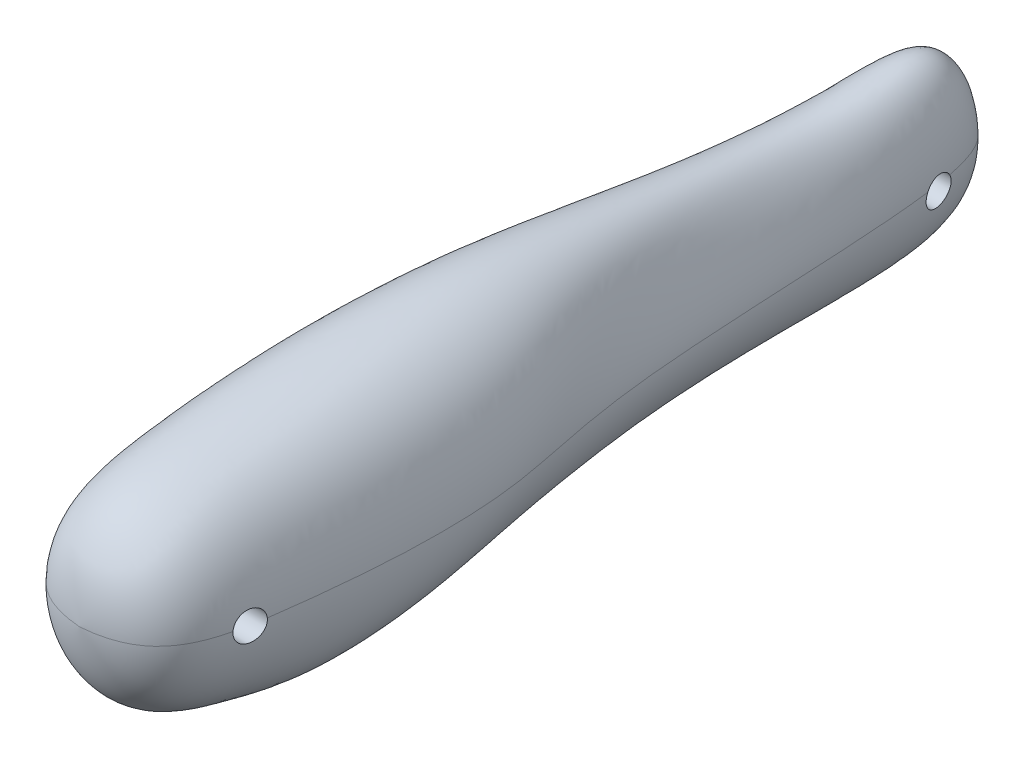
ISO-10303-21;
HEADER;
FILE_DESCRIPTION(('STEP AP214'),'2;1');
FILE_NAME('part.step','',(''),(''),'','','');
FILE_SCHEMA(('AUTOMOTIVE_DESIGN { 1 0 10303 214 1 1 1 1 }'));
ENDSEC;
DATA;
#1=APPLICATION_CONTEXT('core data for automotive mechanical design processes');
#2=APPLICATION_PROTOCOL_DEFINITION('international standard','automotive_design',2000,#1);
#3=PRODUCT_CONTEXT('',#1,'mechanical');
#4=PRODUCT('Part','Part','',(#3));
#5=PRODUCT_RELATED_PRODUCT_CATEGORY('part','',(#4));
#6=PRODUCT_DEFINITION_FORMATION('','',#4);
#7=PRODUCT_DEFINITION_CONTEXT('part definition',#1,'design');
#8=PRODUCT_DEFINITION('design','',#6,#7);
#9=PRODUCT_DEFINITION_SHAPE('','',#8);
#10=(LENGTH_UNIT() NAMED_UNIT(*) SI_UNIT(.MILLI.,.METRE.));
#11=(NAMED_UNIT(*) PLANE_ANGLE_UNIT() SI_UNIT($,.RADIAN.));
#12=(NAMED_UNIT(*) SI_UNIT($,.STERADIAN.) SOLID_ANGLE_UNIT());
#13=UNCERTAINTY_MEASURE_WITH_UNIT(LENGTH_MEASURE(1.E-05),#10,'distance_accuracy_value','');
#14=(GEOMETRIC_REPRESENTATION_CONTEXT(3) GLOBAL_UNCERTAINTY_ASSIGNED_CONTEXT((#13)) GLOBAL_UNIT_ASSIGNED_CONTEXT((#10,
#11,#12)) REPRESENTATION_CONTEXT('',''));
#15=CARTESIAN_POINT('',(0.,0.,0.));
#16=DIRECTION('',(0.,0.,1.));
#17=DIRECTION('',(1.,0.,0.));
#18=AXIS2_PLACEMENT_3D('',#15,#16,#17);
#19=CARTESIAN_POINT('',(-204.079130800979,23.1728124666681,203.553662865172));
#20=CARTESIAN_POINT('',(-204.079130800979,23.1728124666681,203.553662865172));
#21=CARTESIAN_POINT('',(-204.079130800979,23.1728124666681,203.553662865172));
#22=CARTESIAN_POINT('',(-204.079130800979,23.1728124666681,203.553662865172));
#23=CARTESIAN_POINT('',(-204.079130800979,23.1728124666681,203.553662865172));
#24=CARTESIAN_POINT('',(-204.079130800979,23.1728124666681,203.553662865172));
#25=CARTESIAN_POINT('',(-204.079130800979,23.1728124666681,203.553662865172));
#26=CARTESIAN_POINT('',(-228.446348021601,23.1728123364138,201.663956001122));
#27=CARTESIAN_POINT('',(-228.446347912665,30.7846047284628,201.663956001113));
#28=CARTESIAN_POINT('',(-223.17356515452,46.0081892520593,201.663956001114));
#29=CARTESIAN_POINT('',(-204.079130800974,55.4669114657724,201.663956001119));
#30=CARTESIAN_POINT('',(-184.984697101001,46.0081884704255,201.663956001113));
#31=CARTESIAN_POINT('',(-179.711915139516,30.7846044679303,201.663956001122));
#32=CARTESIAN_POINT('',(-179.711915248457,23.1728125969523,201.663956001127));
#33=CARTESIAN_POINT('',(-235.09896902463,23.1728123008254,167.649331490666));
#34=CARTESIAN_POINT('',(-235.098968885958,32.8627398151653,167.649331490667));
#35=CARTESIAN_POINT('',(-228.386636219265,52.2425945121707,167.649331490671));
#36=CARTESIAN_POINT('',(-204.079130800964,64.2836917870659,167.649331490669));
#37=CARTESIAN_POINT('',(-179.771626214686,52.2425935171512,167.649331490673));
#38=CARTESIAN_POINT('',(-173.059294562166,32.8627394834883,167.649331490665));
#39=CARTESIAN_POINT('',(-173.059294700842,23.1728126325041,167.649331490666));
#40=CARTESIAN_POINT('',(-235.098969024636,23.1728123750563,93.0514367049608));
#41=CARTESIAN_POINT('',(-235.098968885964,34.8572991008572,82.7804555502714));
#42=CARTESIAN_POINT('',(-228.386636219268,58.2262723692139,75.7122535183394));
#43=CARTESIAN_POINT('',(-204.079130800979,70.2673696441018,75.7122535183412));
#44=CARTESIAN_POINT('',(-173.445767749332,58.226271374201,75.7122535183345));
#45=CARTESIAN_POINT('',(-166.733436096828,34.8572987691825,82.7804555502685));
#46=CARTESIAN_POINT('',(-166.733436235491,23.1728127067287,93.0514367049615));
#47=CARTESIAN_POINT('',(-225.360000997944,23.909585599777,-3.59644411300675));
#48=CARTESIAN_POINT('',(-225.360000891068,30.7712887533184,-4.7227225278047));
#49=CARTESIAN_POINT('',(-220.185890610079,45.9682413265947,-6.97831727334641));
#50=CARTESIAN_POINT('',(-201.448780884541,56.8976297743172,-6.9783172733402));
#51=CARTESIAN_POINT('',(-189.56468513781,45.9682404234512,28.5733600990794));
#52=CARTESIAN_POINT('',(-180.524773243098,30.7712884522638,46.6297002549608));
#53=CARTESIAN_POINT('',(-180.524773349987,23.9095859008284,47.755978669758));
#54=CARTESIAN_POINT('',(-222.974014375895,22.0127801573685,-88.5817557809478));
#55=CARTESIAN_POINT('',(-222.974014300911,28.4969285711515,-88.0361594975833));
#56=CARTESIAN_POINT('',(-219.343886979934,39.1451607800694,-85.853774364159));
#57=CARTESIAN_POINT('',(-204.089414342494,48.644129886113,-76.7379597415427));
#58=CARTESIAN_POINT('',(-190.94356164348,39.1451599951361,-76.7379597415424));
#59=CARTESIAN_POINT('',(-187.313434870993,28.4969283095003,-78.9203448749691));
#60=CARTESIAN_POINT('',(-187.313434945988,22.0127804190048,-79.4659411583233));
#61=CARTESIAN_POINT('',(-218.99754713462,24.4761486457311,-98.6473785735288));
#62=CARTESIAN_POINT('',(-218.997547067964,32.5725578735586,-98.6473785735281));
#63=CARTESIAN_POINT('',(-215.771600303883,51.3720486873436,-98.6473785735293));
#64=CARTESIAN_POINT('',(-204.089414342491,59.8133968661539,-98.6473785735282));
#65=CARTESIAN_POINT('',(-192.40722878098,51.3720479897896,-98.6473785735324));
#66=CARTESIAN_POINT('',(-189.18128250432,32.572557641054,-98.6473785735307));
#67=CARTESIAN_POINT('',(-189.181282570962,24.4761488782491,-98.6473785735246));
#68=CARTESIAN_POINT('',(-204.089414342501,23.1728124666827,-101.0456694461));
#69=CARTESIAN_POINT('',(-204.089414342501,23.1728124666827,-101.0456694461));
#70=CARTESIAN_POINT('',(-204.089414342501,23.1728124666827,-101.0456694461));
#71=CARTESIAN_POINT('',(-204.089414342501,23.1728124666827,-101.0456694461));
#72=CARTESIAN_POINT('',(-204.089414342501,23.1728124666827,-101.0456694461));
#73=CARTESIAN_POINT('',(-204.089414342501,23.1728124666827,-101.0456694461));
#74=CARTESIAN_POINT('',(-204.089414342501,23.1728124666827,-101.0456694461));
#75=B_SPLINE_SURFACE_WITH_KNOTS('',3,3,((#19,#20,#21,#22,#23,#24,#25),(#26,#27,#28,#29,#30,#31,
#32),(#33,#34,#35,#36,#37,#38,#39),(#40,#41,#42,#43,#44,#45,#46),(#47,#48,#49,#50,#51,#52,#53),
(#54,#55,#56,#57,#58,#59,#60),(#61,#62,#63,#64,#65,#66,#67),(#68,#69,#70,#71,#72,#73,#74)),
.UNSPECIFIED.,.F.,.F.,.F.,(4,1,1,1,1,4),(4,1,1,1,4),(0.,1.,2.,2.582463818436,3.,4.),(2.,3.,4.,
5.,6.),.UNSPECIFIED.);
#76=CARTESIAN_POINT('',(-204.079130800979,23.1728124666681,203.553662865172));
#77=CARTESIAN_POINT('',(-179.711915248457,23.1728125969523,201.663956001127));
#78=CARTESIAN_POINT('',(-173.059294700842,23.1728126325041,167.649331490666));
#79=CARTESIAN_POINT('',(-166.733436235491,23.1728127067287,93.0514367049615));
#80=CARTESIAN_POINT('',(-180.524773349987,23.9095859008284,47.755978669758));
#81=CARTESIAN_POINT('',(-187.313434945988,22.0127804190048,-79.4659411583233));
#82=CARTESIAN_POINT('',(-189.181282570962,24.4761488782491,-98.6473785735246));
#83=CARTESIAN_POINT('',(-204.089414342501,23.1728124666827,-101.0456694461));
#84=B_SPLINE_CURVE_WITH_KNOTS('',3,(#76,#77,#78,#79,#80,#81,#82,#83),.UNSPECIFIED.,.F.,.F.,(4,1,
1,1,1,4),(0.,1.,2.,2.582463818436,3.,4.),.UNSPECIFIED.);
#85=CARTESIAN_POINT('',(-174.423581755346,23.1728126308587,168.58149117894));
#86=VERTEX_POINT('',#85);
#87=CARTESIAN_POINT('',(-187.661687822027,23.1431852475612,-71.9357518170274));
#88=VERTEX_POINT('',#87);
#89=EDGE_CURVE('E62',#86,#88,#84,.T.);
#90=CARTESIAN_POINT('',(-187.661687822027,23.1431852475612,-71.9357518170274));
#91=CARTESIAN_POINT('',(-187.661705745448,23.1434802492214,-71.9359059724172));
#92=CARTESIAN_POINT('',(-187.661723675756,23.1437752351586,-71.9360601570925));
#93=CARTESIAN_POINT('',(-187.661799011974,23.1450141100853,-71.9367078557396));
#94=CARTESIAN_POINT('',(-187.66185648151,23.1459578537512,-71.9372016402818));
#95=CARTESIAN_POINT('',(-187.662144181705,23.1506757690657,-71.9396720633456));
#96=CARTESIAN_POINT('',(-187.662375469354,23.1544475226515,-71.9416531982128));
#97=CARTESIAN_POINT('',(-187.663537542072,23.1732935259989,-71.9515829225591));
#98=CARTESIAN_POINT('',(-187.664485195496,23.1883289051016,-71.9596033606079));
#99=CARTESIAN_POINT('',(-187.66931325052,23.2633073106207,-72.0000932741376));
#100=CARTESIAN_POINT('',(-187.673460776481,23.3226180180187,-72.0337066641822));
#101=CARTESIAN_POINT('',(-187.686752230989,23.4988040490268,-72.1383744394738));
#102=CARTESIAN_POINT('',(-187.696721396605,23.6134966027341,-72.2130431656159));
#103=CARTESIAN_POINT('',(-187.718635557431,23.8363664999352,-72.3715058454538));
#104=CARTESIAN_POINT('',(-187.730582768531,23.9445363489036,-72.4553099966524));
#105=CARTESIAN_POINT('',(-187.756364098404,24.1548400006313,-72.6324886628265));
#106=CARTESIAN_POINT('',(-187.770219933104,24.2568814714559,-72.7259696956889));
#107=CARTESIAN_POINT('',(-187.799448048056,24.4527986001797,-72.9209788846934));
#108=CARTESIAN_POINT('',(-187.814820903222,24.5466711366876,-73.022510088773));
#109=CARTESIAN_POINT('',(-187.846834885769,24.7256902861744,-73.232980822375));
#110=CARTESIAN_POINT('',(-187.863477242508,24.8108282488392,-73.3419275216289));
#111=CARTESIAN_POINT('',(-187.897768381763,24.9717577323642,-73.566429183923));
#112=CARTESIAN_POINT('',(-187.915417539152,25.0475457382047,-73.6819866084456));
#113=CARTESIAN_POINT('',(-187.951764805932,25.1904058783091,-73.920809923912));
#114=CARTESIAN_POINT('',(-187.970475282856,25.2573167767795,-74.0441704179255));
#115=CARTESIAN_POINT('',(-188.008443082379,25.3805325799416,-74.2960521566386));
#116=CARTESIAN_POINT('',(-188.02770060523,25.4368335416621,-74.4245752984918));
#117=CARTESIAN_POINT('',(-188.06652362267,25.5383955521768,-74.6857834635197));
#118=CARTESIAN_POINT('',(-188.086088920159,25.5836633828841,-74.8184658731471));
#119=CARTESIAN_POINT('',(-188.125342567791,25.6629135595647,-75.0871601824386));
#120=CARTESIAN_POINT('',(-188.145030961359,25.6968916636526,-75.2231733129911));
#121=CARTESIAN_POINT('',(-188.204458874392,25.782133597774,-75.6379502023709));
#122=CARTESIAN_POINT('',(-188.24413419497,25.8155939104543,-75.9205935629271));
#123=CARTESIAN_POINT('',(-188.322089265291,25.8340963640293,-76.4876798836972));
#124=CARTESIAN_POINT('',(-188.360368903478,25.8191346430817,-76.7721229856418));
#125=CARTESIAN_POINT('',(-188.416175648899,25.7607536558575,-77.193798290673));
#126=CARTESIAN_POINT('',(-188.434519965335,25.7352766753582,-77.33361015157));
#127=CARTESIAN_POINT('',(-188.470625445262,25.6725046602089,-77.6106127826008));
#128=CARTESIAN_POINT('',(-188.488386826609,25.6352140973789,-77.747804523733));
#129=CARTESIAN_POINT('',(-188.523295772664,25.5490452504219,-78.0186298436561));
#130=CARTESIAN_POINT('',(-188.540443095881,25.5001624637953,-78.1522620173974));
#131=CARTESIAN_POINT('',(-188.574091628562,25.3911751231927,-78.4148966373037));
#132=CARTESIAN_POINT('',(-188.590593078739,25.3310747990536,-78.5439008067787));
#133=CARTESIAN_POINT('',(-188.622888026873,25.2003085671564,-78.7959030381482));
#134=CARTESIAN_POINT('',(-188.638683966072,25.129683474228,-78.9189219681681));
#135=CARTESIAN_POINT('',(-188.669631856489,24.9782273366274,-79.1585277642804));
#136=CARTESIAN_POINT('',(-188.684784044468,24.897400088341,-79.2751169998948));
#137=CARTESIAN_POINT('',(-188.714459216867,24.7261038154231,-79.5010363628258));
#138=CARTESIAN_POINT('',(-188.728982335152,24.6356368564022,-79.610368037186));
#139=CARTESIAN_POINT('',(-188.757412976125,24.4457361668616,-79.8209551048938));
#140=CARTESIAN_POINT('',(-188.771320641952,24.3463045378058,-79.9222123805777));
#141=CARTESIAN_POINT('',(-188.80316638219,24.1039688507355,-80.1488286006383));
#142=CARTESIAN_POINT('',(-188.820872911594,23.9577525178148,-80.2707249662447));
#143=CARTESIAN_POINT('',(-188.846649209652,23.7288772500642,-80.4404005378605));
#144=CARTESIAN_POINT('',(-188.855106949835,23.6510323745034,-80.494741868803));
#145=CARTESIAN_POINT('',(-188.871773572293,23.4923644591102,-80.5989152052403));
#146=CARTESIAN_POINT('',(-188.879982473221,23.411541643518,-80.6487475492912));
#147=CARTESIAN_POINT('',(-188.888072161786,23.3293355912213,-80.6962567637726));
#148=B_SPLINE_CURVE_WITH_KNOTS('',3,(#90,#91,#92,#93,#94,#95,#96,#97,#98,#99,#100,#101,#102,
#103,#104,#105,#106,#107,#108,#109,#110,#111,#112,#113,#114,#115,#116,#117,#118,#119,#120,#121,
#122,#123,#124,#125,#126,#127,#128,#129,#130,#131,#132,#133,#134,#135,#136,#137,#138,#139,#140,
#141,#142,#143,#144,#145,#146,#147),.UNSPECIFIED.,.F.,.F.,(4,2,2,2,2,2,2,2,2,2,2,2,2,2,2,2,2,2,
2,2,2,2,2,2,2,2,2,2,4),(0.,0.00100000000375619,0.00420000017403287,0.017000011045465,
0.0682007064006585,0.273045121255591,0.684188960501245,1.09579653572488,1.51254825519222,
1.92945852472315,2.34677777592888,2.76425343899133,3.18849777055476,3.61289945446656,
4.03703960286047,4.46133893356637,5.31910900312669,6.17694748481065,6.60639864342975,
7.03568743485817,7.46514323889587,7.89443743245127,8.32210818549705,8.74962026198436,
9.17704091411804,9.60436163114551,10.1765100822086,10.462316827816,10.7481020958651),.UNSPECIFIED.);
#149=CARTESIAN_POINT('',(-188.888072161786,23.3293355912213,-80.6962567637726));
#150=VERTEX_POINT('',#149);
#151=EDGE_CURVE('E37',#88,#150,#148,.T.);
#152=CARTESIAN_POINT('',(-204.089414342501,23.1728124666827,-101.0456694461));
#153=VERTEX_POINT('',#152);
#154=EDGE_CURVE('E60',#150,#153,#84,.T.);
#155=CARTESIAN_POINT('',(-204.079130800979,23.1728124666681,203.553662865172));
#156=CARTESIAN_POINT('',(-228.446348021601,23.1728123364138,201.663956001122));
#157=CARTESIAN_POINT('',(-235.09896902463,23.1728123008254,167.649331490666));
#158=CARTESIAN_POINT('',(-235.098969024636,23.1728123750563,93.0514367049608));
#159=CARTESIAN_POINT('',(-225.360000997944,23.909585599777,-3.59644411300675));
#160=CARTESIAN_POINT('',(-222.974014375895,22.0127801573685,-88.5817557809478));
#161=CARTESIAN_POINT('',(-218.99754713462,24.4761486457311,-98.6473785735288));
#162=CARTESIAN_POINT('',(-204.089414342501,23.1728124666827,-101.0456694461));
#163=B_SPLINE_CURVE_WITH_KNOTS('',3,(#155,#156,#157,#158,#159,#160,#161,#162),.UNSPECIFIED.,.F.,
.F.,(4,1,1,1,1,4),(0.,1.,2.,2.582463818436,3.,4.),.UNSPECIFIED.);
#164=CARTESIAN_POINT('',(-204.079130800979,23.1728124666681,203.553662865172));
#165=VERTEX_POINT('',#164);
#166=EDGE_CURVE('E67',#165,#153,#163,.T.);
#167=CARTESIAN_POINT('',(-176.272590131766,23.1728126184348,178.544058142156));
#168=VERTEX_POINT('',#167);
#169=EDGE_CURVE('E69',#165,#168,#84,.T.);
#170=CARTESIAN_POINT('',(-176.272590131766,23.1728126184348,178.544058142156));
#171=CARTESIAN_POINT('',(-176.272590451281,23.1731447038517,178.544029327447));
#172=CARTESIAN_POINT('',(-176.272590766946,23.1734767863897,178.544000479528));
#173=CARTESIAN_POINT('',(-176.272592076566,23.1748715209812,178.543879178788));
#174=CARTESIAN_POINT('',(-176.272593034946,23.175934146384,178.543786419116));
#175=CARTESIAN_POINT('',(-176.272597629703,23.1812471281455,178.543320920325));
#176=CARTESIAN_POINT('',(-176.272600674638,23.1854970388115,178.542943080773));
#177=CARTESIAN_POINT('',(-176.272612743573,23.2067443600269,178.541026665017));
#178=CARTESIAN_POINT('',(-176.272612299725,23.2237344390339,178.539406489939));
#179=CARTESIAN_POINT('',(-176.272559498812,23.3086553899706,178.530869505613));
#180=CARTESIAN_POINT('',(-176.272355357437,23.3764572395926,178.522647899658));
#181=CARTESIAN_POINT('',(-176.271250785285,23.5797669271956,178.493754609911));
#182=CARTESIAN_POINT('',(-176.269856193009,23.7146985041083,178.468882916059));
#183=CARTESIAN_POINT('',(-176.265728000628,23.982180297338,178.408112166429));
#184=CARTESIAN_POINT('',(-176.262992861937,24.1147275954908,178.372200457381));
#185=CARTESIAN_POINT('',(-176.256112678793,24.3780910018471,178.289074175653));
#186=CARTESIAN_POINT('',(-176.251949809569,24.5088623654637,178.241719058315));
#187=CARTESIAN_POINT('',(-176.242192108241,24.7660092236905,178.136285656747));
#188=CARTESIAN_POINT('',(-176.236596733956,24.8923830332771,178.078203314752));
#189=CARTESIAN_POINT('',(-176.223939270043,25.139910598309,177.951693076604));
#190=CARTESIAN_POINT('',(-176.216875851871,25.2610595045933,177.883255824876));
#191=CARTESIAN_POINT('',(-176.201253726615,25.4972099279034,177.736548275549));
#192=CARTESIAN_POINT('',(-176.192694466004,25.6122091486363,177.658274340976));
#193=CARTESIAN_POINT('',(-176.174023429298,25.8356084925811,177.49219102267));
#194=CARTESIAN_POINT('',(-176.163906231312,25.9439836485778,177.404348664208));
#195=CARTESIAN_POINT('',(-176.142116970652,26.1529714219706,177.219971674659));
#196=CARTESIAN_POINT('',(-176.130444335534,26.2535811598433,177.123433847656));
#197=CARTESIAN_POINT('',(-176.105542072204,26.4462388558276,176.922468581177));
#198=CARTESIAN_POINT('',(-176.092313444931,26.5382922505659,176.818046228977));
#199=CARTESIAN_POINT('',(-176.064285341482,26.7133174673053,176.601982950853));
#200=CARTESIAN_POINT('',(-176.049485286814,26.7962859218701,176.490339372525));
#201=CARTESIAN_POINT('',(-176.01825952274,26.9528939731535,176.260175397759));
#202=CARTESIAN_POINT('',(-176.001826932047,27.0264908161582,176.141626845882));
#203=CARTESIAN_POINT('',(-175.967410502568,27.1634657146543,175.898927321336));
#204=CARTESIAN_POINT('',(-175.949426126777,27.2268402107008,175.774774416395));
#205=CARTESIAN_POINT('',(-175.911955767565,27.3429303711589,175.521816166727));
#206=CARTESIAN_POINT('',(-175.892469935329,27.3956471067976,175.393011291112));
#207=CARTESIAN_POINT('',(-175.852057051961,27.49010877281,175.1316583169));
#208=CARTESIAN_POINT('',(-175.831129979578,27.5318535413681,174.999110163129));
#209=CARTESIAN_POINT('',(-175.787690740679,27.6045100411405,174.729802380599));
#210=CARTESIAN_POINT('',(-175.765164246903,27.6353035152809,174.593013156037));
#211=CARTESIAN_POINT('',(-175.71883997655,27.6852694180371,174.317589657337));
#212=CARTESIAN_POINT('',(-175.695042615048,27.7044456159969,174.178955996582));
#213=CARTESIAN_POINT('',(-175.646290830146,27.731116462976,173.900714650699));
#214=CARTESIAN_POINT('',(-175.621335946422,27.7386064228853,173.761106597153));
#215=CARTESIAN_POINT('',(-175.570440805376,27.7418862718169,173.481984332356));
#216=CARTESIAN_POINT('',(-175.544500890603,27.7376801921064,173.342470105344));
#217=CARTESIAN_POINT('',(-175.491391193501,27.7174907285535,173.062260191726));
#218=CARTESIAN_POINT('',(-175.464208526006,27.7013243103299,172.921580117061));
#219=CARTESIAN_POINT('',(-175.409216131246,27.6571608101069,172.642267216221));
#220=CARTESIAN_POINT('',(-175.381406624596,27.6291678307508,172.503633697337));
#221=CARTESIAN_POINT('',(-175.325366066538,27.5615547873953,172.229249639938));
#222=CARTESIAN_POINT('',(-175.297134829931,27.5219294636447,172.093500435454));
#223=CARTESIAN_POINT('',(-175.240520284692,27.4313579956832,171.825922411042));
#224=CARTESIAN_POINT('',(-175.212137033882,27.3804158937531,171.694092210287));
#225=CARTESIAN_POINT('',(-175.15509604428,27.2668020135122,171.433480484221));
#226=CARTESIAN_POINT('',(-175.126439649446,27.20398380639,171.304762469386));
#227=CARTESIAN_POINT('',(-175.069526650296,27.0675160300383,171.053152315796));
#228=CARTESIAN_POINT('',(-175.041269949091,26.9938691368872,170.930258747547));
#229=CARTESIAN_POINT('',(-174.985462411698,26.8362589040791,170.691189793054));
#230=CARTESIAN_POINT('',(-174.957911252251,26.7523003949643,170.57501129832));
#231=CARTESIAN_POINT('',(-174.90378035765,26.5744984886286,170.350028398378));
#232=CARTESIAN_POINT('',(-174.877201689484,26.480644648203,170.241231987007));
#233=CARTESIAN_POINT('',(-174.825415432557,26.2839589068812,170.03217951423));
#234=CARTESIAN_POINT('',(-174.80020503392,26.181146630095,169.931905690863));
#235=CARTESIAN_POINT('',(-174.751405213167,25.9670617109773,169.740404062704));
#236=CARTESIAN_POINT('',(-174.727815753881,25.8557892627688,169.649176050461));
#237=CARTESIAN_POINT('',(-174.682561524067,25.625539999131,169.476482578074));
#238=CARTESIAN_POINT('',(-174.660896760313,25.5065631565882,169.395017152291));
#239=CARTESIAN_POINT('',(-174.619794432494,25.2617970078513,169.242554603156));
#240=CARTESIAN_POINT('',(-174.600355757781,25.1360111453809,169.171552254411));
#241=CARTESIAN_POINT('',(-174.564333340151,24.8810771826472,169.041894282633));
#242=CARTESIAN_POINT('',(-174.547699935787,24.7520480137439,168.983018577489));
#243=CARTESIAN_POINT('',(-174.517065267771,24.4892781307911,168.876391985835));
#244=CARTESIAN_POINT('',(-174.503062048335,24.3555410061147,168.828632826778));
#245=CARTESIAN_POINT('',(-174.477898604567,24.0845105934259,168.744686400552));
#246=CARTESIAN_POINT('',(-174.466733014193,23.9472245666313,168.70847725835));
#247=CARTESIAN_POINT('',(-174.447377678747,23.6699090754413,168.647849109334));
#248=CARTESIAN_POINT('',(-174.439186401304,23.5298810630251,168.623424029215));
#249=CARTESIAN_POINT('',(-174.430846153897,23.3530931900181,168.600299502859));
#250=CARTESIAN_POINT('',(-174.429250634753,23.3170823122047,168.595987417788));
#251=CARTESIAN_POINT('',(-174.426263583161,23.2449988811484,168.588150522389));
#252=CARTESIAN_POINT('',(-174.424871871279,23.2089264107898,168.584625018099));
#253=CARTESIAN_POINT('',(-174.423581755346,23.1728126308587,168.58149117894));
#254=B_SPLINE_CURVE_WITH_KNOTS('',3,(#170,#171,#172,#173,#174,#175,#176,#177,#178,#179,#180,
#181,#182,#183,#184,#185,#186,#187,#188,#189,#190,#191,#192,#193,#194,#195,#196,#197,#198,#199,
#200,#201,#202,#203,#204,#205,#206,#207,#208,#209,#210,#211,#212,#213,#214,#215,#216,#217,#218,
#219,#220,#221,#222,#223,#224,#225,#226,#227,#228,#229,#230,#231,#232,#233,#234,#235,#236,#237,
#238,#239,#240,#241,#242,#243,#244,#245,#246,#247,#248,#249,#250,#251,#252,#253),.UNSPECIFIED.,
.F.,.F.,(4,2,2,2,2,2,2,2,2,2,2,2,2,2,2,2,2,2,2,2,2,2,2,2,2,2,2,2,2,2,2,2,2,2,2,2,2,2,2,2,2,4),
(0.,0.00100000000807665,0.00420000017155761,0.0170000107972527,0.0682006908807987,
0.273044250741563,0.684170611645131,1.09576994389832,1.51270722801989,1.92980255040253,
2.3472769903677,2.76490624217223,3.18402320970653,3.60329485225341,4.02229824559998,
4.44145642531039,4.8624630872658,5.28361602973291,5.70472662043309,6.12584342135733,
6.55137863355911,6.97677570246748,7.40234341835107,7.82776447224059,8.25983422340107,
8.69175421214289,9.12386980204971,9.55583129049503,9.99351435945184,10.4310894456255,
10.868460323279,11.3062974978107,11.743198576154,12.1800896325941,12.6169822266342,
13.0536558860435,13.4815248557081,13.9090743948801,14.3358093058651,14.7623240494115,
14.8712282208958,14.980035928112),.UNSPECIFIED.);
#255=EDGE_CURVE('E43',#168,#86,#254,.T.);
#256=ORIENTED_EDGE('',*,*,#89,.T.);
#257=ORIENTED_EDGE('',*,*,#151,.T.);
#258=ORIENTED_EDGE('',*,*,#154,.T.);
#259=ORIENTED_EDGE('',*,*,#166,.F.);
#260=ORIENTED_EDGE('',*,*,#169,.T.);
#261=ORIENTED_EDGE('',*,*,#255,.T.);
#262=EDGE_LOOP('',(#256,#257,#258,#259,#260,#261));
#263=FACE_BOUND('',#262,.T.);
#264=ADVANCED_FACE('F16',(#263),#75,.F.);
#265=CARTESIAN_POINT('',(-204.079130800979,23.1728124666681,203.553662865172));
#266=CARTESIAN_POINT('',(-204.079130800979,23.1728124666681,203.553662865172));
#267=CARTESIAN_POINT('',(-204.079130800979,23.1728124666681,203.553662865172));
#268=CARTESIAN_POINT('',(-204.079130800979,23.1728124666681,203.553662865172));
#269=CARTESIAN_POINT('',(-204.079130800979,23.1728124666681,203.553662865172));
#270=CARTESIAN_POINT('',(-204.079130800979,23.1728124666681,203.553662865172));
#271=CARTESIAN_POINT('',(-204.079130800979,23.1728124666681,203.553662865172));
#272=CARTESIAN_POINT('',(-179.711915248457,23.1728125969523,201.663956001127));
#273=CARTESIAN_POINT('',(-179.711915357385,15.5610207259566,201.663956001115));
#274=CARTESIAN_POINT('',(-184.984697754578,0.337437244530059,201.663956001116));
#275=CARTESIAN_POINT('',(-204.079130800961,-9.12128432166304,201.663956001118));
#276=CARTESIAN_POINT('',(-223.173563193789,0.337438026164538,201.663956001117));
#277=CARTESIAN_POINT('',(-228.446344794315,15.5610209864944,201.663956001113));
#278=CARTESIAN_POINT('',(-228.446344685375,23.1728123364114,201.663956001122));
#279=CARTESIAN_POINT('',(-173.059294700842,23.1728126325041,167.649331490666));
#280=CARTESIAN_POINT('',(-173.059294839504,13.4828857815265,167.649331490667));
#281=CARTESIAN_POINT('',(-179.771627046692,-5.89696758877578,167.649331490668));
#282=CARTESIAN_POINT('',(-204.07913080097,-17.9380640393852,167.649331490671));
#283=CARTESIAN_POINT('',(-228.386633723238,-5.89696659375677,167.649331490672));
#284=CARTESIAN_POINT('',(-235.098964916237,13.4828861132046,167.649331490663));
#285=CARTESIAN_POINT('',(-235.098964777581,23.1728123008275,167.649331490667));
#286=CARTESIAN_POINT('',(-166.733436235491,23.1728127067287,93.0514367049615));
#287=CARTESIAN_POINT('',(-166.733436374162,11.4883266442523,103.322417859646));
#288=CARTESIAN_POINT('',(-173.445768581341,-11.8806450005546,137.338140446462));
#289=CARTESIAN_POINT('',(-204.079130800962,-23.9217414511615,137.338140446454));
#290=CARTESIAN_POINT('',(-228.386633723232,-11.8806440055359,137.338140446463));
#291=CARTESIAN_POINT('',(-235.098964916247,11.4883269759238,103.322417859641));
#292=CARTESIAN_POINT('',(-235.098964777581,23.1728123750574,93.0514367049567));
#293=CARTESIAN_POINT('',(-180.524773349987,23.9095859008284,47.755978669758));
#294=CARTESIAN_POINT('',(-180.524773456877,17.047883349392,48.8822570845431));
#295=CARTESIAN_POINT('',(-189.564685779148,4.79802511485972,35.3310305878409));
#296=CARTESIAN_POINT('',(-201.448780884547,-6.13136258465163,-0.220646784577339));
#297=CARTESIAN_POINT('',(-220.185888686033,4.79802601802143,-0.22064678457745));
#298=CARTESIAN_POINT('',(-225.359997831059,17.0478836504616,-2.47016569821434));
#299=CARTESIAN_POINT('',(-225.359997724169,23.909585599776,-3.59644411300741));
#300=CARTESIAN_POINT('',(-187.313434945988,22.0127804190048,-79.4659411583233));
#301=CARTESIAN_POINT('',(-187.313435020994,15.5286325285381,-80.0115374416758));
#302=CARTESIAN_POINT('',(-190.943562093433,0.240272652242468,-80.0115374416787));
#303=CARTESIAN_POINT('',(-204.08941434249,-9.25869580350946,-80.0115374416848));
#304=CARTESIAN_POINT('',(-219.343885630056,0.240273437178362,-89.1273520643019));
#305=CARTESIAN_POINT('',(-222.974012154022,15.5286327901823,-89.1273520642994));
#306=CARTESIAN_POINT('',(-222.974012079036,22.0127801573548,-88.5817557809485));
#307=CARTESIAN_POINT('',(-189.181282570962,24.4761488782491,-98.6473785735246));
#308=CARTESIAN_POINT('',(-189.181282637595,16.3797401154376,-98.6473785735329));
#309=CARTESIAN_POINT('',(-192.407229180839,2.79359541296353,-98.6473785735337));
#310=CARTESIAN_POINT('',(-204.089414342494,-5.64775218797609,-98.647378573535));
#311=CARTESIAN_POINT('',(-215.7715991043,2.79359611051799,-98.6473785735311));
#312=CARTESIAN_POINT('',(-218.997545160127,16.3797403479686,-98.6473785735316));
#313=CARTESIAN_POINT('',(-218.997545093489,24.4761486457322,-98.6473785735287));
#314=CARTESIAN_POINT('',(-204.089414342501,23.1728124666827,-101.0456694461));
#315=CARTESIAN_POINT('',(-204.089414342501,23.1728124666827,-101.0456694461));
#316=CARTESIAN_POINT('',(-204.089414342501,23.1728124666827,-101.0456694461));
#317=CARTESIAN_POINT('',(-204.089414342501,23.1728124666827,-101.0456694461));
#318=CARTESIAN_POINT('',(-204.089414342501,23.1728124666827,-101.0456694461));
#319=CARTESIAN_POINT('',(-204.089414342501,23.1728124666827,-101.0456694461));
#320=CARTESIAN_POINT('',(-204.089414342501,23.1728124666827,-101.0456694461));
#321=B_SPLINE_SURFACE_WITH_KNOTS('',3,3,((#265,#266,#267,#268,#269,#270,#271),(#272,#273,#274,
#275,#276,#277,#278),(#279,#280,#281,#282,#283,#284,#285),(#286,#287,#288,#289,#290,#291,#292),
(#293,#294,#295,#296,#297,#298,#299),(#300,#301,#302,#303,#304,#305,#306),(#307,#308,#309,#310,
#311,#312,#313),(#314,#315,#316,#317,#318,#319,#320)),.UNSPECIFIED.,.F.,.F.,.F.,(4,1,1,1,1,4),
(4,1,1,1,4),(0.,1.,2.,2.582463818436,3.,4.),(6.,7.,8.,9.,10.),.UNSPECIFIED.);
#322=CARTESIAN_POINT('',(-188.888072161786,23.3293355912213,-80.6962567637726));
#323=CARTESIAN_POINT('',(-188.888191010142,23.3281278273896,-80.6969547477818));
#324=CARTESIAN_POINT('',(-188.888309832208,23.3269197695123,-80.6976522275176));
#325=CARTESIAN_POINT('',(-188.888790672545,23.3220288198984,-80.7004733193601));
#326=CARTESIAN_POINT('',(-188.88915247293,23.318343494304,-80.7025927500136));
#327=CARTESIAN_POINT('',(-188.890960271579,23.2999031041886,-80.7131665413148));
#328=CARTESIAN_POINT('',(-188.892402607256,23.2851072893295,-80.7215505062392));
#329=CARTESIAN_POINT('',(-188.899595900182,23.2109026854854,-80.7630994779046));
#330=CARTESIAN_POINT('',(-188.905288320946,23.1508516597212,-80.7951320727071));
#331=CARTESIAN_POINT('',(-188.922216884147,22.9683612460504,-80.8877383369747));
#332=CARTESIAN_POINT('',(-188.933264030937,22.8439828541064,-80.9445755350424));
#333=CARTESIAN_POINT('',(-188.954848286963,22.5908224792297,-81.0479384897962));
#334=CARTESIAN_POINT('',(-188.96538480735,22.4620356913919,-81.0944525532094));
#335=CARTESIAN_POINT('',(-188.986045166275,22.1993755541313,-81.1772987784051));
#336=CARTESIAN_POINT('',(-188.996162046712,22.0654583305194,-81.2134938337799));
#337=CARTESIAN_POINT('',(-189.015810008446,21.794990198888,-81.2746514937954));
#338=CARTESIAN_POINT('',(-189.025340872401,21.6584383381005,-81.2996099524078));
#339=CARTESIAN_POINT('',(-189.043780735522,21.3835633331021,-81.3381104818463));
#340=CARTESIAN_POINT('',(-189.052689153693,21.2452386729588,-81.3516420139209));
#341=CARTESIAN_POINT('',(-189.069827841257,20.9678500819983,-81.367148180089));
#342=CARTESIAN_POINT('',(-189.078057858783,20.828785896838,-81.3691185408227));
#343=CARTESIAN_POINT('',(-189.0938784658,20.5491526844341,-81.3614174848243));
#344=CARTESIAN_POINT('',(-189.101459510794,20.4085872071024,-81.3515965735577));
#345=CARTESIAN_POINT('',(-189.11579545746,20.1286921968032,-81.3201161483686));
#346=CARTESIAN_POINT('',(-189.122550048044,19.9893631474342,-81.2984521932444));
#347=CARTESIAN_POINT('',(-189.135148001341,19.7130779252782,-81.2434443732707));
#348=CARTESIAN_POINT('',(-189.140991926888,19.5761203337182,-81.2101077643996));
#349=CARTESIAN_POINT('',(-189.151690147315,19.3054218182972,-81.131966375076));
#350=CARTESIAN_POINT('',(-189.156544076961,19.1716820975808,-81.0871573758722));
#351=CARTESIAN_POINT('',(-189.165149949819,18.9089639192089,-80.9865929251407));
#352=CARTESIAN_POINT('',(-189.168906242928,18.7799684882819,-80.9308821849417));
#353=CARTESIAN_POINT('',(-189.175247341439,18.5270521322025,-80.8087689792254));
#354=CARTESIAN_POINT('',(-189.177831713814,18.4031330981496,-80.7423625738986));
#355=CARTESIAN_POINT('',(-189.181725457036,18.1613528967325,-80.5993684413108));
#356=CARTESIAN_POINT('',(-189.183035274353,18.0434896217747,-80.5227842899643));
#357=CARTESIAN_POINT('',(-189.184279092867,17.8145796388054,-80.3599336077315));
#358=CARTESIAN_POINT('',(-189.184212587836,17.7035354540024,-80.2736635258433));
#359=CARTESIAN_POINT('',(-189.182604344779,17.4896418681841,-80.0925352689051));
#360=CARTESIAN_POINT('',(-189.181069905467,17.3867546494238,-79.9977216847189));
#361=CARTESIAN_POINT('',(-189.176438424784,17.1892653108672,-79.7997912163583));
#362=CARTESIAN_POINT('',(-189.173340808146,17.0946662562596,-79.6966712871061));
#363=CARTESIAN_POINT('',(-189.165493763007,16.9145050809279,-79.4829476567587));
#364=CARTESIAN_POINT('',(-189.160745004439,16.8289393133696,-79.3723470055258));
#365=CARTESIAN_POINT('',(-189.149514052409,16.6673752507558,-79.1443898276888));
#366=CARTESIAN_POINT('',(-189.143031221131,16.5913804912026,-79.0270308277626));
#367=CARTESIAN_POINT('',(-189.128294058174,16.44979294102,-78.7868953941276));
#368=CARTESIAN_POINT('',(-189.120046547089,16.3841617457399,-78.6641412249771));
#369=CARTESIAN_POINT('',(-189.101721806088,16.2633860376336,-78.4136939231602));
#370=CARTESIAN_POINT('',(-189.091643905164,16.2082453858003,-78.2859989927981));
#371=CARTESIAN_POINT('',(-189.058621730912,16.059205259652,-77.8969729586025));
#372=CARTESIAN_POINT('',(-189.032873316353,15.9815336627536,-77.6294386944553));
#373=CARTESIAN_POINT('',(-188.973971196025,15.8715641976246,-77.0854773575594));
#374=CARTESIAN_POINT('',(-188.940800037667,15.8393745945477,-76.8090306627153));
#375=CARTESIAN_POINT('',(-188.867669521575,15.8210865285118,-76.2555211602228));
#376=CARTESIAN_POINT('',(-188.827709772709,15.8349907221628,-75.9784583179826));
#377=CARTESIAN_POINT('',(-188.74151224634,15.9086099711722,-75.4277604089744));
#378=CARTESIAN_POINT('',(-188.695202424931,15.9688938733662,-75.1542111126834));
#379=CARTESIAN_POINT('',(-188.622590978556,16.0924846304879,-74.7550168702537));
#380=CARTESIAN_POINT('',(-188.59784772969,16.1392451088205,-74.623735524551));
#381=CARTESIAN_POINT('',(-188.547542231842,16.2434805250519,-74.3656742007322));
#382=CARTESIAN_POINT('',(-188.521980267453,16.3009517725303,-74.2388926900451));
#383=CARTESIAN_POINT('',(-188.469800691272,16.427399746171,-73.988288371821));
#384=CARTESIAN_POINT('',(-188.443172242563,16.4965751799769,-73.8645682588856));
#385=CARTESIAN_POINT('',(-188.389633595154,16.6451164427278,-73.6235289517366));
#386=CARTESIAN_POINT('',(-188.362723497942,16.7244787097085,-73.5062075404659));
#387=CARTESIAN_POINT('',(-188.308910465574,16.8929048756738,-73.2786648825061));
#388=CARTESIAN_POINT('',(-188.282007538662,16.9819729913652,-73.1684467551982));
#389=CARTESIAN_POINT('',(-188.228552117679,17.1691504238236,-72.9559581893039));
#390=CARTESIAN_POINT('',(-188.201999498356,17.2672564031099,-72.8536848424002));
#391=CARTESIAN_POINT('',(-188.149284530062,17.4729760584247,-72.6567113066158));
#392=CARTESIAN_POINT('',(-188.123129313888,17.5806795900409,-72.562103012144));
#393=CARTESIAN_POINT('',(-188.071853312149,17.803919377422,-72.3824093102945));
#394=CARTESIAN_POINT('',(-188.046732138981,17.9194526544828,-72.297320313744));
#395=CARTESIAN_POINT('',(-187.997841845214,18.1576536296056,-72.1372351986853));
#396=CARTESIAN_POINT('',(-187.974073269203,18.2803241616464,-72.0622431290607));
#397=CARTESIAN_POINT('',(-187.928237114654,18.5318629743317,-71.9230131533373));
#398=CARTESIAN_POINT('',(-187.906168851301,18.6607287254759,-71.8587709053064));
#399=CARTESIAN_POINT('',(-187.86427807892,18.9222769973049,-71.7422151450275));
#400=CARTESIAN_POINT('',(-187.844432574808,19.0548982410034,-71.6897724224449));
#401=CARTESIAN_POINT('',(-187.806983102168,19.3243667148318,-71.5963486504107));
#402=CARTESIAN_POINT('',(-187.789378221368,19.4612121966777,-71.5553629280445));
#403=CARTESIAN_POINT('',(-187.756643427814,19.7382222694939,-71.4851916335306));
#404=CARTESIAN_POINT('',(-187.741514096337,19.8783876311759,-71.4560088304299));
#405=CARTESIAN_POINT('',(-187.713949347493,20.1609069131099,-71.4097559610055));
#406=CARTESIAN_POINT('',(-187.70151281315,20.3032598995879,-71.3926808656729));
#407=CARTESIAN_POINT('',(-187.679792400814,20.5851756773732,-71.3711183663514));
#408=CARTESIAN_POINT('',(-187.670430943284,20.7247069572739,-71.3662963609069));
#409=CARTESIAN_POINT('',(-187.654506219005,21.0037878221928,-71.368348652056));
#410=CARTESIAN_POINT('',(-187.647941830157,21.1433373773624,-71.3752182528008));
#411=CARTESIAN_POINT('',(-187.637659318397,21.4214558138535,-71.4006281227295));
#412=CARTESIAN_POINT('',(-187.633940679482,21.5600248684465,-71.4191662750128));
#413=CARTESIAN_POINT('',(-187.629346701993,21.8351176210237,-71.4677758240949));
#414=CARTESIAN_POINT('',(-187.628470685149,21.9716417991894,-71.4978444677255));
#415=CARTESIAN_POINT('',(-187.629685477941,22.2864087541114,-71.58115457663));
#416=CARTESIAN_POINT('',(-187.632852970661,22.4635206688643,-71.638770680687));
#417=CARTESIAN_POINT('',(-187.641113148969,22.7232363756173,-71.7395710697327));
#418=CARTESIAN_POINT('',(-187.644448841999,22.8087752970993,-71.7755458369684));
#419=CARTESIAN_POINT('',(-187.652240294861,22.9776705089578,-71.852170705235));
#420=CARTESIAN_POINT('',(-187.656695944336,23.0610270134896,-71.8928203454052));
#421=CARTESIAN_POINT('',(-187.661687822027,23.1431852475612,-71.9357518170274));
#422=B_SPLINE_CURVE_WITH_KNOTS('',3,(#322,#323,#324,#325,#326,#327,#328,#329,#330,#331,#332,
#333,#334,#335,#336,#337,#338,#339,#340,#341,#342,#343,#344,#345,#346,#347,#348,#349,#350,#351,
#352,#353,#354,#355,#356,#357,#358,#359,#360,#361,#362,#363,#364,#365,#366,#367,#368,#369,#370,
#371,#372,#373,#374,#375,#376,#377,#378,#379,#380,#381,#382,#383,#384,#385,#386,#387,#388,#389,
#390,#391,#392,#393,#394,#395,#396,#397,#398,#399,#400,#401,#402,#403,#404,#405,#406,#407,#408,
#409,#410,#411,#412,#413,#414,#415,#416,#417,#418,#419,#420,#421),.UNSPECIFIED.,.F.,.F.,(4,2,2,
2,2,2,2,2,2,2,2,2,2,2,2,2,2,2,2,2,2,2,2,2,2,2,2,2,2,2,2,2,2,2,2,2,2,2,2,2,2,2,2,2,2,2,2,2,2,4),
(0.,0.00420000008134781,0.0170000104534989,0.0682006733632299,0.273043141667149,
0.684131864460772,1.09568388770952,1.51247326859875,1.9294163087517,2.34674346574748,
2.7642248698101,3.18705564020294,3.61004508316555,4.03277205203124,4.45565469446133,
4.87683800472359,5.29817681658766,5.7193679820236,6.14071406956296,6.55997601257214,
6.97939236126798,7.39863873434977,7.81803952439051,8.23584767857941,8.65380930878204,
9.48883141003704,10.3258378649677,11.1628925614961,12.0103806813193,12.4346079434619,
12.8586893064459,13.2908669379891,13.7228938623405,14.1551092348316,14.5871656348063,
15.0238074868607,15.4602841478751,15.8969353187177,16.3334096949858,16.7648426454134,
17.1960993716408,17.6274572150906,18.0586357863608,18.4779068568548,18.8970095699057,
19.3160362715371,19.7349629832091,20.2923992464685,20.5708413061892,20.8492559398824),.UNSPECIFIED.);
#423=EDGE_CURVE('E11',#150,#88,#422,.T.);
#424=CARTESIAN_POINT('',(-174.423581755346,23.1728126308587,168.58149117894));
#425=CARTESIAN_POINT('',(-174.423531964155,23.171418753833,168.581370233676));
#426=CARTESIAN_POINT('',(-174.423482324679,23.1700248206341,168.581249872975));
#427=CARTESIAN_POINT('',(-174.423282017081,23.1643824810504,168.580765064772));
#428=CARTESIAN_POINT('',(-174.423132606652,23.1601336131296,168.580405462716));
#429=CARTESIAN_POINT('',(-174.422392598877,23.1388865338034,168.578634594384));
#430=CARTESIAN_POINT('',(-174.421823158466,23.1218807701505,168.577304811832));
#431=CARTESIAN_POINT('',(-174.419088558438,23.0368014850767,168.571089791917));
#432=CARTESIAN_POINT('',(-174.417262732907,22.9686193323545,168.567509944773));
#433=CARTESIAN_POINT('',(-174.412869504453,22.7633818165452,168.560949124151));
#434=CARTESIAN_POINT('',(-174.411408173349,22.6261429751786,168.562204983986));
#435=CARTESIAN_POINT('',(-174.411441412442,22.3520914895943,168.57600023023));
#436=CARTESIAN_POINT('',(-174.412939407851,22.2152795230254,168.588552682492));
#437=CARTESIAN_POINT('',(-174.418846515489,21.9440399341589,168.624747844845));
#438=CARTESIAN_POINT('',(-174.423237834339,21.8096028630667,168.648322514715));
#439=CARTESIAN_POINT('',(-174.434843383179,21.5431723072429,168.706357964676));
#440=CARTESIAN_POINT('',(-174.442058678842,21.4111797647092,168.740822853415));
#441=CARTESIAN_POINT('',(-174.459208256992,21.1504953281497,168.82039321442));
#442=CARTESIAN_POINT('',(-174.46914495658,21.0218064800663,168.865508140915));
#443=CARTESIAN_POINT('',(-174.491592313209,20.7686873666504,168.966021072664));
#444=CARTESIAN_POINT('',(-174.504103934553,20.6442587171764,169.021422929594));
#445=CARTESIAN_POINT('',(-174.531564793221,20.4001650201908,169.142253661396));
#446=CARTESIAN_POINT('',(-174.546521482912,20.2805159731245,169.20771315324));
#447=CARTESIAN_POINT('',(-174.578646993861,20.0471347518426,169.348057888793));
#448=CARTESIAN_POINT('',(-174.595816619168,19.9334047494456,169.422946558276));
#449=CARTESIAN_POINT('',(-174.632129993558,19.7126952932154,169.581531353449));
#450=CARTESIAN_POINT('',(-174.65127263897,19.6057121187424,169.665222555696));
#451=CARTESIAN_POINT('',(-174.691309437803,19.3990527674241,169.840877854902));
#452=CARTESIAN_POINT('',(-174.712204245909,19.299379348141,169.932845045088));
#453=CARTESIAN_POINT('',(-174.756045707177,19.1055387113641,170.126837093511));
#454=CARTESIAN_POINT('',(-174.779031152988,19.0115773326316,170.229058933356));
#455=CARTESIAN_POINT('',(-174.826313678553,18.8325758091932,170.440813271974));
#456=CARTESIAN_POINT('',(-174.850611241585,18.7475389859769,170.55034846795));
#457=CARTESIAN_POINT('',(-174.900235040582,18.5869612388878,170.775929234522));
#458=CARTESIAN_POINT('',(-174.925561078318,18.5114184965116,170.891973552177));
#459=CARTESIAN_POINT('',(-174.976978058614,18.3702586137935,171.129803678945));
#460=CARTESIAN_POINT('',(-175.003069282706,18.304645182817,171.251591611566));
#461=CARTESIAN_POINT('',(-175.083440715412,18.1202762409947,171.630726936392));
#462=CARTESIAN_POINT('',(-175.138563391396,18.0180297796256,171.896183976404));
#463=CARTESIAN_POINT('',(-175.248753754138,17.85994371503,172.440394703456));
#464=CARTESIAN_POINT('',(-175.303821437143,17.804107088916,172.719149242294));
#465=CARTESIAN_POINT('',(-175.412689680992,17.7400886799293,173.285561481344));
#466=CARTESIAN_POINT('',(-175.466471354212,17.7324035464907,173.573281303329));
#467=CARTESIAN_POINT('',(-175.54450651455,17.7579176745149,174.002832693336));
#468=CARTESIAN_POINT('',(-175.570091716808,17.7726138957232,174.14575469931));
#469=CARTESIAN_POINT('',(-175.620245272667,17.8142779658275,174.429964475435));
#470=CARTESIAN_POINT('',(-175.644814015173,17.8412410730726,174.571252855429));
#471=CARTESIAN_POINT('',(-175.692654908135,17.9070957526176,174.850313849683));
#472=CARTESIAN_POINT('',(-175.715933962053,17.9459146808857,174.988102487383));
#473=CARTESIAN_POINT('',(-175.761238345954,18.0352796157814,175.259978620046));
#474=CARTESIAN_POINT('',(-175.783264158155,18.0858210733375,175.394067528206));
#475=CARTESIAN_POINT('',(-175.825990622133,18.1983348093981,175.657635462151));
#476=CARTESIAN_POINT('',(-175.846690817502,18.2603109966691,175.787112893471));
#477=CARTESIAN_POINT('',(-175.886682815441,18.3952425135231,176.040378039782));
#478=CARTESIAN_POINT('',(-175.905975165605,18.4681935401644,176.164167959972));
#479=CARTESIAN_POINT('',(-175.942871128931,18.6235785397098,176.403603251813));
#480=CARTESIAN_POINT('',(-175.960493340646,18.70587781097,176.519333189195));
#481=CARTESIAN_POINT('',(-175.994288199693,18.8801020636092,176.743459763038));
#482=CARTESIAN_POINT('',(-176.010461409644,18.9720232786627,176.85185924172));
#483=CARTESIAN_POINT('',(-176.041351169865,19.1648988989379,177.060576355248));
#484=CARTESIAN_POINT('',(-176.0560673522,19.2658555736487,177.160891947526));
#485=CARTESIAN_POINT('',(-176.08402518297,19.4760251569163,177.352606879351));
#486=CARTESIAN_POINT('',(-176.097267396339,19.5852348751638,177.444009633281));
#487=CARTESIAN_POINT('',(-176.122141869197,19.8098744209977,177.616254750839));
#488=CARTESIAN_POINT('',(-176.133790713634,19.9252194629284,177.697205315958));
#489=CARTESIAN_POINT('',(-176.155655877936,20.1623818574167,177.849108284037));
#490=CARTESIAN_POINT('',(-176.16587274637,20.2841967066826,177.92006451574));
#491=CARTESIAN_POINT('',(-176.184896449654,20.5335676810507,178.05153036201));
#492=CARTESIAN_POINT('',(-176.19370216818,20.6611282502511,178.112031708928));
#493=CARTESIAN_POINT('',(-176.209902311135,20.9209356996614,178.222039022334));
#494=CARTESIAN_POINT('',(-176.217297266952,21.0531807930215,178.271549130017));
#495=CARTESIAN_POINT('',(-176.230651420353,21.3206456895376,178.358963785099));
#496=CARTESIAN_POINT('',(-176.236618931463,21.4558430013733,178.396935898983));
#497=CARTESIAN_POINT('',(-176.247182586933,21.7289516498862,178.461372442385));
#498=CARTESIAN_POINT('',(-176.25177926391,21.8668619102318,178.487841343126));
#499=CARTESIAN_POINT('',(-176.25960523917,22.1442401361352,178.529060791101));
#500=CARTESIAN_POINT('',(-176.262836608663,22.2837054103635,178.543829118446));
#501=CARTESIAN_POINT('',(-176.267943783341,22.5633488651602,178.561593954153));
#502=CARTESIAN_POINT('',(-176.269820381544,22.7035265802242,178.564597353711));
#503=CARTESIAN_POINT('',(-176.271490435807,22.8985388833107,178.560582379388));
#504=CARTESIAN_POINT('',(-176.271856878269,22.9535066442901,178.558542257384));
#505=CARTESIAN_POINT('',(-176.272380232412,23.0632776392366,178.552653352737));
#506=CARTESIAN_POINT('',(-176.272537404117,23.1180809928019,178.548806822655));
#507=CARTESIAN_POINT('',(-176.272590131766,23.1728126184348,178.544058142156));
#508=B_SPLINE_CURVE_WITH_KNOTS('',3,(#424,#425,#426,#427,#428,#429,#430,#431,#432,#433,#434,
#435,#436,#437,#438,#439,#440,#441,#442,#443,#444,#445,#446,#447,#448,#449,#450,#451,#452,#453,
#454,#455,#456,#457,#458,#459,#460,#461,#462,#463,#464,#465,#466,#467,#468,#469,#470,#471,#472,
#473,#474,#475,#476,#477,#478,#479,#480,#481,#482,#483,#484,#485,#486,#487,#488,#489,#490,#491,
#492,#493,#494,#495,#496,#497,#498,#499,#500,#501,#502,#503,#504,#505,#506,#507),.UNSPECIFIED.,
.F.,.F.,(4,2,2,2,2,2,2,2,2,2,2,2,2,2,2,2,2,2,2,2,2,2,2,2,2,2,2,2,2,2,2,2,2,2,2,2,2,2,2,2,2,4),
(0.,0.00420000008641089,0.0170000112441831,0.0682007257216906,0.273046537006045,
0.684267210379443,1.09596412157592,1.50515251681466,1.91449547485524,2.32420318967961,
2.7340646195131,3.14519939764687,3.55648398112767,3.96753973560414,4.3787497691804,
4.80046964245476,5.22234591652457,5.64414126053941,6.06609379079212,6.93094402520539,
7.79584973402128,8.66966185994105,9.10703830773495,9.54424583517543,9.97882645737107,
10.4132387165522,10.8477997481807,11.2821908419356,11.7109694298178,12.1395808037448,
12.5683001382617,12.9968545858618,13.4205390916159,13.8440608433733,14.2679159954792,
14.6916111786734,15.112775136922,15.5337752447955,15.9541343701184,16.374247237174,
16.5392438476918,16.7040352543656),.UNSPECIFIED.);
#509=EDGE_CURVE('E31',#86,#168,#508,.T.);
#510=ORIENTED_EDGE('',*,*,#154,.F.);
#511=ORIENTED_EDGE('',*,*,#423,.T.);
#512=ORIENTED_EDGE('',*,*,#89,.F.);
#513=ORIENTED_EDGE('',*,*,#509,.T.);
#514=ORIENTED_EDGE('',*,*,#169,.F.);
#515=ORIENTED_EDGE('',*,*,#166,.T.);
#516=EDGE_LOOP('',(#510,#511,#512,#513,#514,#515));
#517=FACE_BOUND('',#516,.T.);
#518=ADVANCED_FACE('F18',(#517),#321,.F.);
#519=CARTESIAN_POINT('',(-203.837642670015,22.7405917599833,173.562774660005));
#520=DIRECTION('',(1.,0.,0.));
#521=DIRECTION('',(0.,0.,-1.));
#522=AXIS2_PLACEMENT_3D('',#519,#520,#521);
#523=CYLINDRICAL_SURFACE('',#522,5.);
#524=CARTESIAN_POINT('',(-203.837642670015,22.7405917599833,173.562774660005));
#525=DIRECTION('',(1.,0.,0.));
#526=DIRECTION('',(0.,0.,-1.));
#527=AXIS2_PLACEMENT_3D('',#524,#525,#526);
#528=CIRCLE('',#527,5.);
#529=CARTESIAN_POINT('',(-203.837642670015,22.7405917599834,168.562774660005));
#530=VERTEX_POINT('',#529);
#531=EDGE_CURVE('E63',#530,#530,#528,.T.);
#532=ORIENTED_EDGE('',*,*,#531,.F.);
#533=EDGE_LOOP('',(#532));
#534=FACE_BOUND('',#533,.T.);
#535=ORIENTED_EDGE('',*,*,#509,.F.);
#536=ORIENTED_EDGE('',*,*,#255,.F.);
#537=EDGE_LOOP('',(#535,#536));
#538=FACE_BOUND('',#537,.T.);
#539=ADVANCED_FACE('F78',(#534,#538),#523,.F.);
#540=CARTESIAN_POINT('',(-203.837642670015,22.7405917599833,173.562774660005));
#541=DIRECTION('',(1.,0.,0.));
#542=DIRECTION('',(0.,0.,-1.));
#543=AXIS2_PLACEMENT_3D('',#540,#541,#542);
#544=PLANE('',#543);
#545=ORIENTED_EDGE('',*,*,#531,.T.);
#546=EDGE_LOOP('',(#545));
#547=FACE_BOUND('',#546,.T.);
#548=ADVANCED_FACE('F82',(#547),#544,.T.);
#549=CARTESIAN_POINT('',(-203.976821900006,20.8275044000031,-76.3671874999897));
#550=DIRECTION('',(1.,0.,0.));
#551=DIRECTION('',(0.,0.,-1.));
#552=AXIS2_PLACEMENT_3D('',#549,#550,#551);
#553=CYLINDRICAL_SURFACE('',#552,5.);
#554=CARTESIAN_POINT('',(-203.976821900006,20.8275044000031,-76.3671874999897));
#555=DIRECTION('',(1.,0.,0.));
#556=DIRECTION('',(0.,0.,-1.));
#557=AXIS2_PLACEMENT_3D('',#554,#555,#556);
#558=CIRCLE('',#557,5.);
#559=CARTESIAN_POINT('',(-203.976821900006,20.8275044000032,-81.3671874999897));
#560=VERTEX_POINT('',#559);
#561=EDGE_CURVE('E64',#560,#560,#558,.T.);
#562=ORIENTED_EDGE('',*,*,#561,.F.);
#563=EDGE_LOOP('',(#562));
#564=FACE_BOUND('',#563,.T.);
#565=ORIENTED_EDGE('',*,*,#423,.F.);
#566=ORIENTED_EDGE('',*,*,#151,.F.);
#567=EDGE_LOOP('',(#565,#566));
#568=FACE_BOUND('',#567,.T.);
#569=ADVANCED_FACE('F54',(#564,#568),#553,.F.);
#570=CARTESIAN_POINT('',(-203.976821900006,20.8275044000031,-76.3671874999897));
#571=DIRECTION('',(1.,0.,0.));
#572=DIRECTION('',(0.,0.,-1.));
#573=AXIS2_PLACEMENT_3D('',#570,#571,#572);
#574=PLANE('',#573);
#575=ORIENTED_EDGE('',*,*,#561,.T.);
#576=EDGE_LOOP('',(#575));
#577=FACE_BOUND('',#576,.T.);
#578=ADVANCED_FACE('F106',(#577),#574,.T.);
#579=CLOSED_SHELL('',(#264,#518,#539,#548,#569,#578));
#580=MANIFOLD_SOLID_BREP('B1',#579);
#581=ADVANCED_BREP_SHAPE_REPRESENTATION('',(#18,#580),#14);
#582=SHAPE_DEFINITION_REPRESENTATION(#9,#581);
ENDSEC;
END-ISO-10303-21;
